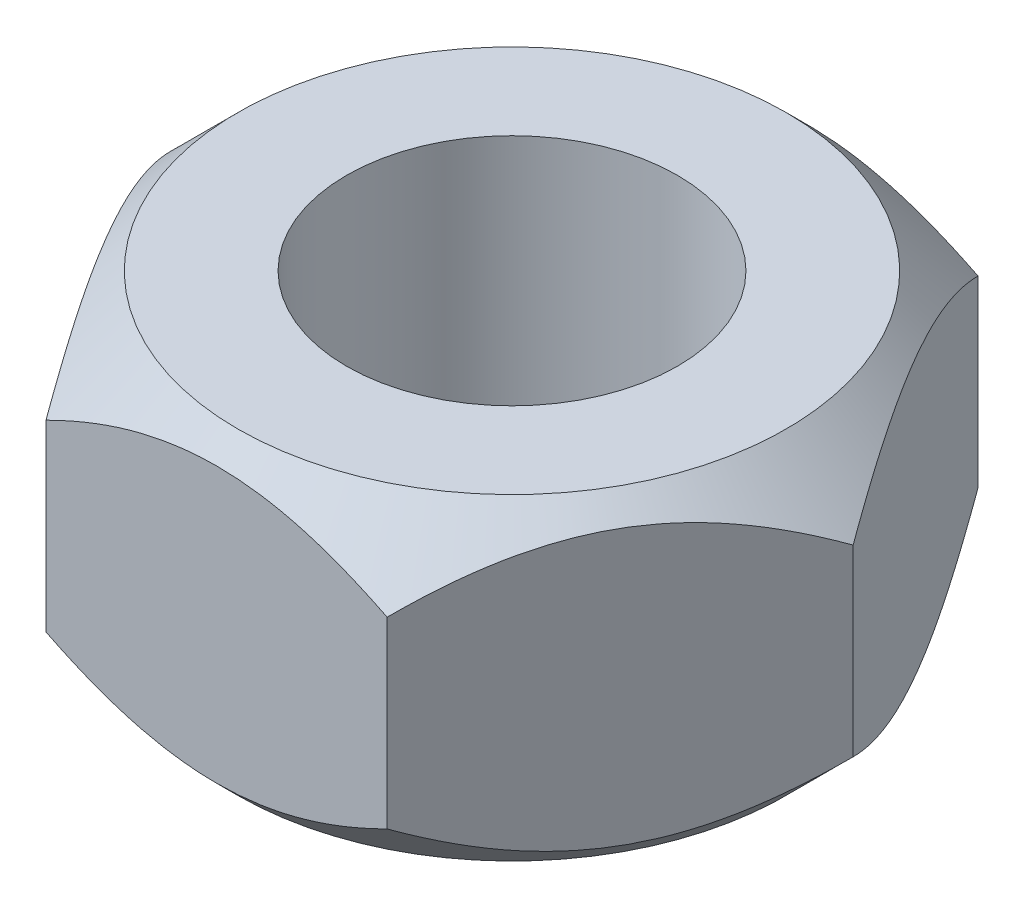
ISO-10303-21;
HEADER;
FILE_DESCRIPTION(('STEP AP214'),'2;1');
FILE_NAME('part.step','',(''),(''),'','','');
FILE_SCHEMA(('AUTOMOTIVE_DESIGN { 1 0 10303 214 1 1 1 1 }'));
ENDSEC;
DATA;
#1=APPLICATION_CONTEXT('core data for automotive mechanical design processes');
#2=APPLICATION_PROTOCOL_DEFINITION('international standard','automotive_design',2000,#1);
#3=PRODUCT_CONTEXT('',#1,'mechanical');
#4=PRODUCT('Part','Part','',(#3));
#5=PRODUCT_RELATED_PRODUCT_CATEGORY('part','',(#4));
#6=PRODUCT_DEFINITION_FORMATION('','',#4);
#7=PRODUCT_DEFINITION_CONTEXT('part definition',#1,'design');
#8=PRODUCT_DEFINITION('design','',#6,#7);
#9=PRODUCT_DEFINITION_SHAPE('','',#8);
#10=(LENGTH_UNIT() NAMED_UNIT(*) SI_UNIT(.MILLI.,.METRE.));
#11=(NAMED_UNIT(*) PLANE_ANGLE_UNIT() SI_UNIT($,.RADIAN.));
#12=(NAMED_UNIT(*) SI_UNIT($,.STERADIAN.) SOLID_ANGLE_UNIT());
#13=UNCERTAINTY_MEASURE_WITH_UNIT(LENGTH_MEASURE(1.E-05),#10,'distance_accuracy_value','');
#14=(GEOMETRIC_REPRESENTATION_CONTEXT(3) GLOBAL_UNCERTAINTY_ASSIGNED_CONTEXT((#13)) GLOBAL_UNIT_ASSIGNED_CONTEXT((#10,
#11,#12)) REPRESENTATION_CONTEXT('',''));
#15=CARTESIAN_POINT('',(0.,0.,0.));
#16=DIRECTION('',(0.,0.,1.));
#17=DIRECTION('',(1.,0.,0.));
#18=AXIS2_PLACEMENT_3D('',#15,#16,#17);
#19=CARTESIAN_POINT('',(-3.20790243318486,2.9845,-5.55625));
#20=DIRECTION('',(0.,1.,0.));
#21=DIRECTION('',(0.,0.,1.));
#22=AXIS2_PLACEMENT_3D('',#19,#20,#21);
#23=PLANE('',#22);
#24=CARTESIAN_POINT('',(0.,2.9845,0.));
#25=DIRECTION('',(0.,1.,0.));
#26=DIRECTION('',(0.,0.,1.));
#27=AXIS2_PLACEMENT_3D('',#24,#25,#26);
#28=CIRCLE('',#27,3.1115);
#29=CARTESIAN_POINT('',(0.,2.9845,3.1115));
#30=VERTEX_POINT('',#29);
#31=EDGE_CURVE('E118',#30,#30,#28,.T.);
#32=ORIENTED_EDGE('',*,*,#31,.F.);
#33=EDGE_LOOP('',(#32));
#34=FACE_BOUND('',#33,.T.);
#35=CARTESIAN_POINT('',(0.,2.9845,0.));
#36=DIRECTION('',(0.,1.,0.));
#37=DIRECTION('',(0.,0.,1.));
#38=AXIS2_PLACEMENT_3D('',#35,#36,#37);
#39=CIRCLE('',#38,5.1562);
#40=CARTESIAN_POINT('',(0.,2.9845,5.1562));
#41=VERTEX_POINT('',#40);
#42=EDGE_CURVE('E138',#41,#41,#39,.T.);
#43=ORIENTED_EDGE('',*,*,#42,.T.);
#44=EDGE_LOOP('',(#43));
#45=FACE_BOUND('',#44,.T.);
#46=ADVANCED_FACE('F38',(#34,#45),#23,.T.);
#47=CARTESIAN_POINT('',(3.20790243318486,2.9845,-5.55625));
#48=DIRECTION('',(0.,0.,1.));
#49=DIRECTION('',(1.,0.,0.));
#50=AXIS2_PLACEMENT_3D('',#47,#48,#49);
#51=PLANE('',#50);
#52=DIRECTION('',(0.,-1.,0.));
#53=VECTOR('',#52,1.);
#54=CARTESIAN_POINT('',(3.20790243318486,2.9845,-5.55625));
#55=LINE('',#54,#53);
#56=CARTESIAN_POINT('',(3.20790243318486,1.72489513363029,-5.55625));
#57=VERTEX_POINT('',#56);
#58=CARTESIAN_POINT('',(3.20790243318486,-1.72489513363029,-5.55625));
#59=VERTEX_POINT('',#58);
#60=EDGE_CURVE('E114',#57,#59,#55,.T.);
#61=ORIENTED_EDGE('',*,*,#60,.T.);
#62=CARTESIAN_POINT('',(-6.58716469272115,0.476878125641333,-5.55625));
#63=CARTESIAN_POINT('',(-6.42759897434799,0.354935686013452,-5.55625));
#64=CARTESIAN_POINT('',(-6.26716138850675,0.234115958327013,-5.55625));
#65=CARTESIAN_POINT('',(-5.94419054054148,-0.00476878868405201,-5.55625));
#66=CARTESIAN_POINT('',(-5.78165678131663,-0.122833135209353,-5.55625));
#67=CARTESIAN_POINT('',(-5.45295294674766,-0.356538146996847,-5.55625));
#68=CARTESIAN_POINT('',(-5.28676447473106,-0.472153023225434,-5.55625));
#69=CARTESIAN_POINT('',(-4.95160120628765,-0.699257298894547,-5.55625));
#70=CARTESIAN_POINT('',(-4.78262660456582,-0.810746984866885,-5.55625));
#71=CARTESIAN_POINT('',(-4.43100221981947,-1.03533013587308,-5.55625));
#72=CARTESIAN_POINT('',(-4.24814791761083,-1.14810500400876,-5.55625));
#73=CARTESIAN_POINT('',(-3.87815305880905,-1.36650801407209,-5.55625));
#74=CARTESIAN_POINT('',(-3.69101180276069,-1.4721349784769,-5.55625));
#75=CARTESIAN_POINT('',(-3.31241641028587,-1.67398189672136,-5.55625));
#76=CARTESIAN_POINT('',(-3.12097712644039,-1.77022949090869,-5.55625));
#77=CARTESIAN_POINT('',(-2.73275367196412,-1.95116173151524,-5.55625));
#78=CARTESIAN_POINT('',(-2.53597203844707,-2.03585175538824,-5.55625));
#79=CARTESIAN_POINT('',(-2.15511884734095,-2.18347146354552,-5.55625));
#80=CARTESIAN_POINT('',(-1.97155135984943,-2.24768832799283,-5.55625));
#81=CARTESIAN_POINT('',(-1.59983135631393,-2.36141837840469,-5.55625));
#82=CARTESIAN_POINT('',(-1.41167854105872,-2.41093060203691,-5.55625));
#83=CARTESIAN_POINT('',(-1.03513439085919,-2.49178158953953,-5.55625));
#84=CARTESIAN_POINT('',(-0.846813640191315,-2.52344361984717,-5.55625));
#85=CARTESIAN_POINT('',(-0.467949294264373,-2.5679493289881,-5.55625));
#86=CARTESIAN_POINT('',(-0.277406137616722,-2.58079665978109,-5.55625));
#87=CARTESIAN_POINT('',(0.0961888430357952,-2.5866285227101,-5.55625));
#88=CARTESIAN_POINT('',(0.279228517917821,-2.58040349207286,-5.55625));
#89=CARTESIAN_POINT('',(0.643830731082311,-2.55022547525135,-5.55625));
#90=CARTESIAN_POINT('',(0.825393130043499,-2.52627083614589,-5.55625));
#91=CARTESIAN_POINT('',(1.18880053870515,-2.46156368670595,-5.55625));
#92=CARTESIAN_POINT('',(1.37059256449986,-2.42051850784193,-5.55625));
#93=CARTESIAN_POINT('',(1.73018969466418,-2.32387551778916,-5.55625));
#94=CARTESIAN_POINT('',(1.90799506409663,-2.26827867723761,-5.55625));
#95=CARTESIAN_POINT('',(2.27157071863707,-2.14061985217526,-5.55625));
#96=CARTESIAN_POINT('',(2.45702885672605,-2.06767853094191,-5.55625));
#97=CARTESIAN_POINT('',(2.82316011598931,-1.91054903999559,-5.55625));
#98=CARTESIAN_POINT('',(3.00383101042669,-1.82635574288271,-5.55625));
#99=CARTESIAN_POINT('',(3.36125061944279,-1.64872081295941,-5.55625));
#100=CARTESIAN_POINT('',(3.5379849666029,-1.55525050530099,-5.55625));
#101=CARTESIAN_POINT('',(3.88739837866309,-1.36112147109617,-5.55625));
#102=CARTESIAN_POINT('',(4.0600780691791,-1.26046386333351,-5.55625));
#103=CARTESIAN_POINT('',(4.39345679128326,-1.05849144282289,-5.55625));
#104=CARTESIAN_POINT('',(4.55432579831417,-0.957455712364276,-5.55625));
#105=CARTESIAN_POINT('',(4.873300549823,-0.751099856717646,-5.55625));
#106=CARTESIAN_POINT('',(5.03140608509287,-0.645779409147224,-5.55625));
#107=CARTESIAN_POINT('',(5.34394061065362,-0.432480295246411,-5.55625));
#108=CARTESIAN_POINT('',(5.49838896306111,-0.324529897192919,-5.55625));
#109=CARTESIAN_POINT('',(5.80516933006379,-0.105747547949723,-5.55625));
#110=CARTESIAN_POINT('',(5.95750191598365,0.00508360118402249,-5.55625));
#111=CARTESIAN_POINT('',(6.10894746272345,0.11709348039263,-5.55625));
#112=B_SPLINE_CURVE_WITH_KNOTS('',3,(#62,#63,#64,#65,#66,#67,#68,#69,#70,#71,#72,#73,#74,#75,
#76,#77,#78,#79,#80,#81,#82,#83,#84,#85,#86,#87,#88,#89,#90,#91,#92,#93,#94,#95,#96,#97,#98,#99,
#100,#101,#102,#103,#104,#105,#106,#107,#108,#109,#110,#111),.UNSPECIFIED.,.F.,.F.,(4,2,2,2,2,2,
2,2,2,2,2,2,2,2,2,2,2,2,2,2,2,2,2,2,4),(0.,0.602490068317835,1.20512574309909,1.81241969099542,
2.41967137733875,3.06404499949269,3.70852451657861,4.35104340427867,4.99326231698966,
5.57618348178354,6.15914278694025,6.73117443800682,7.30309504220085,7.85163808129495,
8.40023226718405,8.95863465486317,9.51699980500329,10.11439916794,10.7120716932762,
11.311652812297,11.9111408024158,12.4809589718086,13.0508200939394,13.616087999598,
14.1812001749851),.UNSPECIFIED.);
#113=CARTESIAN_POINT('',(-3.20790243318486,-1.72489513363029,-5.55625));
#114=VERTEX_POINT('',#113);
#115=EDGE_CURVE('E59',#59,#114,#112,.F.);
#116=ORIENTED_EDGE('',*,*,#115,.T.);
#117=DIRECTION('',(0.,-1.,0.));
#118=VECTOR('',#117,1.);
#119=CARTESIAN_POINT('',(-3.20790243318486,2.9845,-5.55625));
#120=LINE('',#119,#118);
#121=CARTESIAN_POINT('',(-3.20790243318486,1.72489513363029,-5.55625));
#122=VERTEX_POINT('',#121);
#123=EDGE_CURVE('E52',#122,#114,#120,.T.);
#124=ORIENTED_EDGE('',*,*,#123,.F.);
#125=CARTESIAN_POINT('',(-6.59835940382583,-0.48543823704191,-5.55625));
#126=CARTESIAN_POINT('',(-6.43856810067453,-0.363237243894523,-5.55625));
#127=CARTESIAN_POINT('',(-6.27790496400973,-0.242158151216455,-5.55625));
#128=CARTESIAN_POINT('',(-5.95448263127668,-0.00275306593156922,-5.55625));
#129=CARTESIAN_POINT('',(-5.79172293911305,0.115572255760569,-5.55625));
#130=CARTESIAN_POINT('',(-5.46256482457612,0.349802677105666,-5.55625));
#131=CARTESIAN_POINT('',(-5.29614800196142,0.465682004896323,-5.55625));
#132=CARTESIAN_POINT('',(-4.96052631123378,0.693316591413599,-5.55625));
#133=CARTESIAN_POINT('',(-4.79132163776439,0.805072136306378,-5.55625));
#134=CARTESIAN_POINT('',(-4.43917961004767,1.03023000978025,-5.55625));
#135=CARTESIAN_POINT('',(-4.25603673568171,1.1433125285767,-5.55625));
#136=CARTESIAN_POINT('',(-3.88545707411041,1.36232695880489,-5.55625));
#137=CARTESIAN_POINT('',(-3.69801958464599,1.46825768943084,-5.55625));
#138=CARTESIAN_POINT('',(-3.31882144640119,1.67070288371502,-5.55625));
#139=CARTESIAN_POINT('',(-3.12707568396022,1.76724501266209,-5.55625));
#140=CARTESIAN_POINT('',(-2.73822362099179,1.94875041091287,-5.55625));
#141=CARTESIAN_POINT('',(-2.54111986890989,2.03371907324309,-5.55625));
#142=CARTESIAN_POINT('',(-2.15976657401889,2.18179136804636,-5.55625));
#143=CARTESIAN_POINT('',(-1.97602645317706,2.24619358312019,-5.55625));
#144=CARTESIAN_POINT('',(-1.60394723537393,2.3602816703545,-5.55625));
#145=CARTESIAN_POINT('',(-1.41560783915726,2.40996658214596,-5.55625));
#146=CARTESIAN_POINT('',(-1.03868650053877,2.49113450558752,-5.55625));
#147=CARTESIAN_POINT('',(-0.85017561545771,2.5229419979048,-5.55625));
#148=CARTESIAN_POINT('',(-0.470916497685076,2.56770554292561,-5.55625));
#149=CARTESIAN_POINT('',(-0.280168709590943,2.58066527979688,-5.55625));
#150=CARTESIAN_POINT('',(0.0937819219496482,2.58667445461626,-5.55625));
#151=CARTESIAN_POINT('',(0.276972135057729,2.58052150422772,-5.55625));
#152=CARTESIAN_POINT('',(0.641879388971021,2.55045498950042,-5.55625));
#153=CARTESIAN_POINT('',(0.82359629119246,2.52653977354452,-5.55625));
#154=CARTESIAN_POINT('',(1.18731847720738,2.46187907858606,-5.55625));
#155=CARTESIAN_POINT('',(1.36927068367381,2.42083996086929,-5.55625));
#156=CARTESIAN_POINT('',(1.72918300612716,2.32417969252025,-5.55625));
#157=CARTESIAN_POINT('',(1.90714338346456,2.26855949957358,-5.55625));
#158=CARTESIAN_POINT('',(2.27080293040271,2.14090884840685,-5.55625));
#159=CARTESIAN_POINT('',(2.45619546621416,2.06801437106223,-5.55625));
#160=CARTESIAN_POINT('',(2.82219886337606,1.91098330539244,-5.55625));
#161=CARTESIAN_POINT('',(3.0028075022317,1.8268415979182,-5.55625));
#162=CARTESIAN_POINT('',(3.36010458540898,1.64931313942241,-5.55625));
#163=CARTESIAN_POINT('',(3.53677868125748,1.55589774408657,-5.55625));
#164=CARTESIAN_POINT('',(3.88607358666566,1.36188029033257,-5.55625));
#165=CARTESIAN_POINT('',(4.05869502080687,1.26127934911424,-5.55625));
#166=CARTESIAN_POINT('',(4.39196371579547,1.05941711133094,-5.55625));
#167=CARTESIAN_POINT('',(4.55278084095246,0.95843477464817,-5.55625));
#168=CARTESIAN_POINT('',(4.87165264984985,0.752186149742702,-5.55625));
#169=CARTESIAN_POINT('',(5.02970712452459,0.646919539293572,-5.55625));
#170=CARTESIAN_POINT('',(5.34214104908368,0.433727508042609,-5.55625));
#171=CARTESIAN_POINT('',(5.49653984830345,0.325830341936151,-5.55625));
#172=CARTESIAN_POINT('',(5.80322150613526,0.107154506056544,-5.55625));
#173=CARTESIAN_POINT('',(5.95550493600945,-0.00362336161582645,-5.55625));
#174=CARTESIAN_POINT('',(6.10690143830326,-0.115579987963722,-5.55625));
#175=B_SPLINE_CURVE_WITH_KNOTS('',3,(#125,#126,#127,#128,#129,#130,#131,#132,#133,#134,#135,
#136,#137,#138,#139,#140,#141,#142,#143,#144,#145,#146,#147,#148,#149,#150,#151,#152,#153,#154,
#155,#156,#157,#158,#159,#160,#161,#162,#163,#164,#165,#166,#167,#168,#169,#170,#171,#172,#173,
#174),.UNSPECIFIED.,.F.,.F.,(4,2,2,2,2,2,2,2,2,2,2,2,2,2,2,2,2,2,2,2,2,2,2,2,4),(0.,
0.603498786457322,1.20714309880031,1.81545262490647,2.42371985823581,3.06931496865048,
3.71501641156752,4.35875353774578,5.00218966025262,5.58578316732119,6.16941474805749,
6.74207957260603,7.31463244340017,7.86361723193485,8.41265307399219,8.97151802144452,
9.53034627181685,10.1275114979222,10.7249494537119,11.3242938444236,11.923545251802,
12.4931464224893,13.0627905131618,13.6278450792169,14.192743961769),.UNSPECIFIED.);
#176=EDGE_CURVE('E137',#57,#122,#175,.F.);
#177=ORIENTED_EDGE('',*,*,#176,.F.);
#178=EDGE_LOOP('',(#61,#116,#124,#177));
#179=FACE_BOUND('',#178,.T.);
#180=ADVANCED_FACE('F40',(#179),#51,.F.);
#181=CARTESIAN_POINT('',(-3.20790243318486,2.9845,-5.55625));
#182=DIRECTION('',(0.866025403784439,0.,0.5));
#183=DIRECTION('',(0.5,0.,-0.866025403784439));
#184=AXIS2_PLACEMENT_3D('',#181,#182,#183);
#185=PLANE('',#184);
#186=ORIENTED_EDGE('',*,*,#123,.T.);
#187=CARTESIAN_POINT('',(-3.20778696313102,-1.7247796604592,-5.55645));
#188=CARTESIAN_POINT('',(-3.26294502630456,-1.77993242203482,-5.46091343213634));
#189=CARTESIAN_POINT('',(-3.31852706224861,-1.83339263942161,-5.36464252189313));
#190=CARTESIAN_POINT('',(-3.43062225818461,-1.93641311667276,-5.17048794724758));
#191=CARTESIAN_POINT('',(-3.48713590663451,-1.985971246525,-5.07260343681127));
#192=CARTESIAN_POINT('',(-3.6587240703033,-2.12844281917033,-4.77540401935948));
#193=CARTESIAN_POINT('',(-3.77525117089692,-2.21454564665251,-4.57357316067263));
#194=CARTESIAN_POINT('',(-4.01023739378267,-2.36199085611819,-4.16656508355582));
#195=CARTESIAN_POINT('',(-4.12863645427789,-2.42370470595628,-3.96149189520967));
#196=CARTESIAN_POINT('',(-4.30818158421301,-2.49509250337744,-3.65051060791049));
#197=CARTESIAN_POINT('',(-4.36829430156956,-2.51534839260829,-3.54639232726793));
#198=CARTESIAN_POINT('',(-4.48902872199999,-2.5483408034146,-3.33727417686004));
#199=CARTESIAN_POINT('',(-4.54965034763144,-2.56107844876182,-3.23227444122895));
#200=CARTESIAN_POINT('',(-4.69737632802703,-2.58243487487139,-2.97640553758585));
#201=CARTESIAN_POINT('',(-4.78463985035014,-2.58691592717982,-2.82526068327482));
#202=CARTESIAN_POINT('',(-4.95900962187742,-2.57939519640635,-2.52324337968538));
#203=CARTESIAN_POINT('',(-5.04611580523527,-2.56738763540787,-2.37237104445617));
#204=CARTESIAN_POINT('',(-5.21950695589982,-2.52759747805152,-2.07204876192234));
#205=CARTESIAN_POINT('',(-5.30579089490739,-2.49979724001053,-1.92260059568406));
#206=CARTESIAN_POINT('',(-5.4768757650541,-2.42993312732754,-1.62627290818363));
#207=CARTESIAN_POINT('',(-5.5616768093829,-2.38787034639007,-1.47939319087125));
#208=CARTESIAN_POINT('',(-5.71221493158858,-2.3013336350814,-1.218653514735));
#209=CARTESIAN_POINT('',(-5.7782853256609,-2.2591354571075,-1.10421623532564));
#210=CARTESIAN_POINT('',(-5.9092400536356,-2.16793889719049,-0.877395992982099));
#211=CARTESIAN_POINT('',(-5.97412435147949,-2.118940308896,-0.765013092503062));
#212=CARTESIAN_POINT('',(-6.10250252581459,-2.01524132435942,-0.542655571971716));
#213=CARTESIAN_POINT('',(-6.16600005347445,-1.96055885880868,-0.43267462790984));
#214=CARTESIAN_POINT('',(-6.29181929109853,-1.84621006386822,-0.214749315775358));
#215=CARTESIAN_POINT('',(-6.35414169387201,-1.78654679124865,-0.106803747721918));
#216=CARTESIAN_POINT('',(-6.41592033642355,-1.72477966045921,0.000199999999999559));
#217=B_SPLINE_CURVE_WITH_KNOTS('',3,(#187,#188,#189,#190,#191,#192,#193,#194,#195,#196,#197,
#198,#199,#200,#201,#202,#203,#204,#205,#206,#207,#208,#209,#210,#211,#212,#213,#214,#215,#216),
.UNSPECIFIED.,.F.,.F.,(4,2,2,2,2,2,2,2,2,2,2,2,2,2,4),(0.,0.369982774103464,0.740166128456627,
1.48452951278214,2.21707291656615,2.58262618134807,2.94812479207227,3.47106468924809,
3.99418788105353,4.51789659566179,5.04156515942817,5.4575151537856,5.8734777724733,
6.28816585755633,6.70260128950947),.UNSPECIFIED.);
#218=CARTESIAN_POINT('',(-6.41580486636972,-1.72489513363029,0.));
#219=VERTEX_POINT('',#218);
#220=EDGE_CURVE('E133',#114,#219,#217,.T.);
#221=ORIENTED_EDGE('',*,*,#220,.T.);
#222=DIRECTION('',(0.,-1.,0.));
#223=VECTOR('',#222,1.);
#224=CARTESIAN_POINT('',(-6.41580486636972,2.9845,0.));
#225=LINE('',#224,#223);
#226=CARTESIAN_POINT('',(-6.41580486636972,1.72489513363029,0.));
#227=VERTEX_POINT('',#226);
#228=EDGE_CURVE('E124',#227,#219,#225,.T.);
#229=ORIENTED_EDGE('',*,*,#228,.F.);
#230=CARTESIAN_POINT('',(-3.20778696313102,1.7247796604592,-5.55645));
#231=CARTESIAN_POINT('',(-3.26294502630456,1.77993242203482,-5.46091343213634));
#232=CARTESIAN_POINT('',(-3.31852706224861,1.83339263942161,-5.36464252189313));
#233=CARTESIAN_POINT('',(-3.43062225818461,1.93641311667276,-5.17048794724758));
#234=CARTESIAN_POINT('',(-3.48713590663451,1.985971246525,-5.07260343681127));
#235=CARTESIAN_POINT('',(-3.6587240703033,2.12844281917033,-4.77540401935948));
#236=CARTESIAN_POINT('',(-3.77525117089692,2.21454564665251,-4.57357316067264));
#237=CARTESIAN_POINT('',(-4.01023739378267,2.36199085611819,-4.16656508355582));
#238=CARTESIAN_POINT('',(-4.12863645427789,2.42370470595628,-3.96149189520967));
#239=CARTESIAN_POINT('',(-4.30818158421301,2.49509250337744,-3.65051060791049));
#240=CARTESIAN_POINT('',(-4.36829430156955,2.51534839260829,-3.54639232726793));
#241=CARTESIAN_POINT('',(-4.48902872199999,2.5483408034146,-3.33727417686004));
#242=CARTESIAN_POINT('',(-4.54965034763144,2.56107844876182,-3.23227444122895));
#243=CARTESIAN_POINT('',(-4.69737632802703,2.58243487487139,-2.97640553758585));
#244=CARTESIAN_POINT('',(-4.78463985035014,2.58691592717982,-2.82526068327482));
#245=CARTESIAN_POINT('',(-4.95900962187742,2.57939519640635,-2.52324337968539));
#246=CARTESIAN_POINT('',(-5.04611580523527,2.56738763540787,-2.37237104445617));
#247=CARTESIAN_POINT('',(-5.21950695589982,2.52759747805152,-2.07204876192234));
#248=CARTESIAN_POINT('',(-5.30579089490739,2.49979724001053,-1.92260059568406));
#249=CARTESIAN_POINT('',(-5.4768757650541,2.42993312732754,-1.62627290818363));
#250=CARTESIAN_POINT('',(-5.5616768093829,2.38787034639007,-1.47939319087125));
#251=CARTESIAN_POINT('',(-5.71221493158858,2.3013336350814,-1.218653514735));
#252=CARTESIAN_POINT('',(-5.7782853256609,2.2591354571075,-1.10421623532564));
#253=CARTESIAN_POINT('',(-5.9092400536356,2.16793889719049,-0.877395992982099));
#254=CARTESIAN_POINT('',(-5.97412435147949,2.118940308896,-0.765013092503062));
#255=CARTESIAN_POINT('',(-6.1025025258146,2.01524132435942,-0.542655571971717));
#256=CARTESIAN_POINT('',(-6.16600005347445,1.96055885880868,-0.432674627909841));
#257=CARTESIAN_POINT('',(-6.29181929109853,1.84621006386822,-0.214749315775358));
#258=CARTESIAN_POINT('',(-6.35414169387201,1.78654679124865,-0.106803747721918));
#259=CARTESIAN_POINT('',(-6.41592033642355,1.72477966045921,0.000199999999999559));
#260=B_SPLINE_CURVE_WITH_KNOTS('',3,(#230,#231,#232,#233,#234,#235,#236,#237,#238,#239,#240,
#241,#242,#243,#244,#245,#246,#247,#248,#249,#250,#251,#252,#253,#254,#255,#256,#257,#258,#259),
.UNSPECIFIED.,.F.,.F.,(4,2,2,2,2,2,2,2,2,2,2,2,2,2,4),(0.,0.369982774103464,0.740166128456627,
1.48452951278214,2.21707291656615,2.58262618134806,2.94812479207227,3.47106468924808,
3.99418788105353,4.51789659566178,5.04156515942817,5.4575151537856,5.8734777724733,
6.28816585755633,6.70260128950947),.UNSPECIFIED.);
#261=EDGE_CURVE('E134',#122,#227,#260,.T.);
#262=ORIENTED_EDGE('',*,*,#261,.F.);
#263=EDGE_LOOP('',(#186,#221,#229,#262));
#264=FACE_BOUND('',#263,.T.);
#265=ADVANCED_FACE('F131',(#264),#185,.F.);
#266=CARTESIAN_POINT('',(-6.41580486636972,2.9845,0.));
#267=DIRECTION('',(0.866025403784439,0.,-0.5));
#268=DIRECTION('',(-0.5,0.,-0.866025403784439));
#269=AXIS2_PLACEMENT_3D('',#266,#267,#268);
#270=PLANE('',#269);
#271=ORIENTED_EDGE('',*,*,#228,.T.);
#272=CARTESIAN_POINT('',(-6.41592033642355,-1.72477966045921,-0.000200000000000268));
#273=CARTESIAN_POINT('',(-6.36076227325002,-1.77993242203482,0.0953365678636604));
#274=CARTESIAN_POINT('',(-6.30518023730597,-1.83339263942161,0.191607478106872));
#275=CARTESIAN_POINT('',(-6.19308504136997,-1.93641311667276,0.385762052752415));
#276=CARTESIAN_POINT('',(-6.13657139292006,-1.985971246525,0.483646563188731));
#277=CARTESIAN_POINT('',(-5.96498322925127,-2.12844281917033,0.780845980640522));
#278=CARTESIAN_POINT('',(-5.84845612865765,-2.21454564665251,0.982676839327363));
#279=CARTESIAN_POINT('',(-5.61346990577191,-2.36199085611819,1.38968491644418));
#280=CARTESIAN_POINT('',(-5.49507084527668,-2.42370470595628,1.59475810479033));
#281=CARTESIAN_POINT('',(-5.31552571534156,-2.49509250337744,1.90573939208951));
#282=CARTESIAN_POINT('',(-5.25541299798502,-2.51534839260829,2.00985767273207));
#283=CARTESIAN_POINT('',(-5.13467857755459,-2.5483408034146,2.21897582313996));
#284=CARTESIAN_POINT('',(-5.07405695192314,-2.56107844876182,2.32397555877105));
#285=CARTESIAN_POINT('',(-4.92633097152755,-2.58243487487139,2.57984446241414));
#286=CARTESIAN_POINT('',(-4.83906744920444,-2.58691592717982,2.73098931672518));
#287=CARTESIAN_POINT('',(-4.66469767767716,-2.57939519640635,3.03300662031461));
#288=CARTESIAN_POINT('',(-4.57759149431931,-2.56738763540787,3.18387895554382));
#289=CARTESIAN_POINT('',(-4.40420034365476,-2.52759747805152,3.48420123807765));
#290=CARTESIAN_POINT('',(-4.31791640464719,-2.49979724001053,3.63364940431594));
#291=CARTESIAN_POINT('',(-4.14683153450048,-2.42993312732755,3.92997709181636));
#292=CARTESIAN_POINT('',(-4.06203049017168,-2.38787034639007,4.07685680912874));
#293=CARTESIAN_POINT('',(-3.911492367966,-2.3013336350814,4.337596485265));
#294=CARTESIAN_POINT('',(-3.84542197389367,-2.25913545710751,4.45203376467436));
#295=CARTESIAN_POINT('',(-3.71446724591897,-2.16793889719049,4.6788540070179));
#296=CARTESIAN_POINT('',(-3.64958294807509,-2.118940308896,4.79123690749693));
#297=CARTESIAN_POINT('',(-3.52120477373998,-2.01524132435942,5.01359442802828));
#298=CARTESIAN_POINT('',(-3.45770724608013,-1.96055885880868,5.12357537209016));
#299=CARTESIAN_POINT('',(-3.33188800845605,-1.84621006386822,5.34150068422464));
#300=CARTESIAN_POINT('',(-3.26956560568257,-1.78654679124865,5.44944625227808));
#301=CARTESIAN_POINT('',(-3.20778696313102,-1.72477966045921,5.55645));
#302=B_SPLINE_CURVE_WITH_KNOTS('',3,(#272,#273,#274,#275,#276,#277,#278,#279,#280,#281,#282,
#283,#284,#285,#286,#287,#288,#289,#290,#291,#292,#293,#294,#295,#296,#297,#298,#299,#300,#301),
.UNSPECIFIED.,.F.,.F.,(4,2,2,2,2,2,2,2,2,2,2,2,2,2,4),(0.,0.369982774103463,0.740166128456623,
1.48452951278213,2.21707291656614,2.58262618134806,2.94812479207227,3.47106468924808,
3.99418788105352,4.51789659566178,5.04156515942817,5.45751515378559,5.87347777247329,
6.28816585755633,6.70260128950947),.UNSPECIFIED.);
#303=CARTESIAN_POINT('',(-3.20790243318486,-1.72489513363029,5.55625));
#304=VERTEX_POINT('',#303);
#305=EDGE_CURVE('E142',#219,#304,#302,.T.);
#306=ORIENTED_EDGE('',*,*,#305,.T.);
#307=DIRECTION('',(0.,-1.,0.));
#308=VECTOR('',#307,1.);
#309=CARTESIAN_POINT('',(-3.20790243318486,2.9845,5.55625));
#310=LINE('',#309,#308);
#311=CARTESIAN_POINT('',(-3.20790243318486,1.72489513363029,5.55625));
#312=VERTEX_POINT('',#311);
#313=EDGE_CURVE('E116',#312,#304,#310,.T.);
#314=ORIENTED_EDGE('',*,*,#313,.F.);
#315=CARTESIAN_POINT('',(-6.41592033642355,1.72477966045921,-0.000200000000000268));
#316=CARTESIAN_POINT('',(-6.36076227325002,1.77993242203482,0.0953365678636604));
#317=CARTESIAN_POINT('',(-6.30518023730597,1.83339263942161,0.191607478106872));
#318=CARTESIAN_POINT('',(-6.19308504136997,1.93641311667276,0.385762052752415));
#319=CARTESIAN_POINT('',(-6.13657139292006,1.985971246525,0.483646563188731));
#320=CARTESIAN_POINT('',(-5.96498322925127,2.12844281917033,0.780845980640522));
#321=CARTESIAN_POINT('',(-5.84845612865765,2.21454564665251,0.982676839327363));
#322=CARTESIAN_POINT('',(-5.61346990577191,2.36199085611819,1.38968491644418));
#323=CARTESIAN_POINT('',(-5.49507084527668,2.42370470595628,1.59475810479033));
#324=CARTESIAN_POINT('',(-5.31552571534156,2.49509250337744,1.90573939208951));
#325=CARTESIAN_POINT('',(-5.25541299798502,2.51534839260829,2.00985767273207));
#326=CARTESIAN_POINT('',(-5.13467857755459,2.5483408034146,2.21897582313996));
#327=CARTESIAN_POINT('',(-5.07405695192314,2.56107844876182,2.32397555877105));
#328=CARTESIAN_POINT('',(-4.92633097152755,2.58243487487139,2.57984446241414));
#329=CARTESIAN_POINT('',(-4.83906744920444,2.58691592717982,2.73098931672518));
#330=CARTESIAN_POINT('',(-4.66469767767716,2.57939519640635,3.03300662031461));
#331=CARTESIAN_POINT('',(-4.57759149431931,2.56738763540787,3.18387895554382));
#332=CARTESIAN_POINT('',(-4.40420034365476,2.52759747805152,3.48420123807765));
#333=CARTESIAN_POINT('',(-4.31791640464719,2.49979724001053,3.63364940431594));
#334=CARTESIAN_POINT('',(-4.14683153450048,2.42993312732755,3.92997709181636));
#335=CARTESIAN_POINT('',(-4.06203049017168,2.38787034639007,4.07685680912874));
#336=CARTESIAN_POINT('',(-3.911492367966,2.3013336350814,4.337596485265));
#337=CARTESIAN_POINT('',(-3.84542197389367,2.25913545710751,4.45203376467436));
#338=CARTESIAN_POINT('',(-3.71446724591897,2.16793889719049,4.6788540070179));
#339=CARTESIAN_POINT('',(-3.64958294807509,2.118940308896,4.79123690749693));
#340=CARTESIAN_POINT('',(-3.52120477373998,2.01524132435942,5.01359442802828));
#341=CARTESIAN_POINT('',(-3.45770724608013,1.96055885880868,5.12357537209016));
#342=CARTESIAN_POINT('',(-3.33188800845605,1.84621006386822,5.34150068422464));
#343=CARTESIAN_POINT('',(-3.26956560568257,1.78654679124865,5.44944625227808));
#344=CARTESIAN_POINT('',(-3.20778696313102,1.72477966045921,5.55645));
#345=B_SPLINE_CURVE_WITH_KNOTS('',3,(#315,#316,#317,#318,#319,#320,#321,#322,#323,#324,#325,
#326,#327,#328,#329,#330,#331,#332,#333,#334,#335,#336,#337,#338,#339,#340,#341,#342,#343,#344),
.UNSPECIFIED.,.F.,.F.,(4,2,2,2,2,2,2,2,2,2,2,2,2,2,4),(0.,0.369982774103463,0.740166128456623,
1.48452951278213,2.21707291656614,2.58262618134806,2.94812479207227,3.47106468924808,
3.99418788105352,4.51789659566178,5.04156515942817,5.45751515378559,5.87347777247329,
6.28816585755633,6.70260128950947),.UNSPECIFIED.);
#346=EDGE_CURVE('E191',#227,#312,#345,.T.);
#347=ORIENTED_EDGE('',*,*,#346,.F.);
#348=EDGE_LOOP('',(#271,#306,#314,#347));
#349=FACE_BOUND('',#348,.T.);
#350=ADVANCED_FACE('F182',(#349),#270,.F.);
#351=CARTESIAN_POINT('',(-3.20790243318486,2.9845,5.55625));
#352=DIRECTION('',(0.,0.,-1.));
#353=DIRECTION('',(-1.,0.,0.));
#354=AXIS2_PLACEMENT_3D('',#351,#352,#353);
#355=PLANE('',#354);
#356=ORIENTED_EDGE('',*,*,#313,.T.);
#357=CARTESIAN_POINT('',(-6.58716469267499,0.47687812560604,5.55625));
#358=CARTESIAN_POINT('',(-6.42759897430314,0.354935685979523,5.55625));
#359=CARTESIAN_POINT('',(-6.26716138846322,0.234115958294446,5.55625));
#360=CARTESIAN_POINT('',(-5.94419054050062,-0.00476878871390234,5.55625));
#361=CARTESIAN_POINT('',(-5.7816567812771,-0.122833135237849,5.55625));
#362=CARTESIAN_POINT('',(-5.45295294671085,-0.356538147022625,5.55625));
#363=CARTESIAN_POINT('',(-5.28676447469563,-0.47215302324985,5.55625));
#364=CARTESIAN_POINT('',(-4.95160120625501,-0.699257298916258,5.55625));
#365=CARTESIAN_POINT('',(-4.78262660453458,-0.810746984887253,5.55625));
#366=CARTESIAN_POINT('',(-4.43100221979127,-1.03533013589065,5.55625));
#367=CARTESIAN_POINT('',(-4.24814791758426,-1.14810500402488,5.55625));
#368=CARTESIAN_POINT('',(-3.8781530587858,-1.36650801408537,5.55625));
#369=CARTESIAN_POINT('',(-3.69101180273913,-1.47213497848881,5.55625));
#370=CARTESIAN_POINT('',(-3.31241641026776,-1.67398189673061,5.55625));
#371=CARTESIAN_POINT('',(-3.12097712642402,-1.77022949091667,5.55625));
#372=CARTESIAN_POINT('',(-2.73275367195135,-1.95116173152084,5.55625));
#373=CARTESIAN_POINT('',(-2.53597203843615,-2.03585175539273,5.55625));
#374=CARTESIAN_POINT('',(-2.1551188473308,-2.18347146354922,5.55625));
#375=CARTESIAN_POINT('',(-1.97155135983814,-2.24768832799665,5.55625));
#376=CARTESIAN_POINT('',(-1.5998313563003,-2.36141837840851,5.55625));
#377=CARTESIAN_POINT('',(-1.4116785410439,-2.41093060204061,5.55625));
#378=CARTESIAN_POINT('',(-1.03513439084204,-2.49178158954271,5.55625));
#379=CARTESIAN_POINT('',(-0.846813640173009,-2.52344361984997,5.55625));
#380=CARTESIAN_POINT('',(-0.4679492942438,-2.56794932898987,5.55625));
#381=CARTESIAN_POINT('',(-0.277406137595033,-2.58079665978221,5.55625));
#382=CARTESIAN_POINT('',(0.0961888430594437,-2.58662852270973,5.55625));
#383=CARTESIAN_POINT('',(0.279228517942314,-2.58040349207166,5.55625));
#384=CARTESIAN_POINT('',(0.643830731108402,-2.55022547524838,5.55625));
#385=CARTESIAN_POINT('',(0.825393130070344,-2.52627083614196,5.55625));
#386=CARTESIAN_POINT('',(1.18880053873349,-2.46156368670004,5.55625));
#387=CARTESIAN_POINT('',(1.37059256452892,-2.42051850783499,5.55625));
#388=CARTESIAN_POINT('',(1.73018969469463,-2.32387551778011,5.55625));
#389=CARTESIAN_POINT('',(1.90799506412774,-2.26827867722752,5.55625));
#390=CARTESIAN_POINT('',(2.27157071867183,-2.14061985216217,5.55625));
#391=CARTESIAN_POINT('',(2.45702885676374,-2.06767853092672,5.55625));
#392=CARTESIAN_POINT('',(2.8231601160327,-1.91054903997598,5.55625));
#393=CARTESIAN_POINT('',(3.00383101047286,-1.82635574286079,5.55625));
#394=CARTESIAN_POINT('',(3.36125061949442,-1.64872081293272,5.55625));
#395=CARTESIAN_POINT('',(3.53798496665721,-1.55525050527185,5.55625));
#396=CARTESIAN_POINT('',(3.88739837872266,-1.36112147106204,5.55625));
#397=CARTESIAN_POINT('',(4.06007806924127,-1.26046386329685,5.55625));
#398=CARTESIAN_POINT('',(4.39345679135013,-1.05849144278143,5.55625));
#399=CARTESIAN_POINT('',(4.55432579838316,-0.957455712320547,5.55625));
#400=CARTESIAN_POINT('',(4.87330054989621,-0.75109985666938,5.55625));
#401=CARTESIAN_POINT('',(5.03140608516817,-0.645779409096686,5.55625));
#402=CARTESIAN_POINT('',(5.34394061073306,-0.432480295191352,5.55625));
#403=CARTESIAN_POINT('',(5.49838896314259,-0.324529897135613,5.55625));
#404=CARTESIAN_POINT('',(5.80516933014933,-0.105747547887925,5.55625));
#405=CARTESIAN_POINT('',(5.95750191607122,0.00508360124806539,5.55625));
#406=CARTESIAN_POINT('',(6.10894746281304,0.117093480458914,5.55625));
#407=B_SPLINE_CURVE_WITH_KNOTS('',3,(#357,#358,#359,#360,#361,#362,#363,#364,#365,#366,#367,
#368,#369,#370,#371,#372,#373,#374,#375,#376,#377,#378,#379,#380,#381,#382,#383,#384,#385,#386,
#387,#388,#389,#390,#391,#392,#393,#394,#395,#396,#397,#398,#399,#400,#401,#402,#403,#404,#405,
#406),.UNSPECIFIED.,.F.,.F.,(4,2,2,2,2,2,2,2,2,2,2,2,2,2,2,2,2,2,2,2,2,2,2,2,4),(0.,
0.602490068312204,1.20512574308783,1.81241969097842,2.41967137731602,3.0640449994635,
3.70852451654297,4.35104340423664,4.99326231694123,5.57618348173846,6.15914278689851,
6.73117443796827,7.3030950421655,7.85163808126221,8.40023226715392,8.95863465483586,
9.51699980497881,10.114399167926,10.7120716932727,11.311652812304,11.9111408024333,
12.4809589718351,13.050820093975,13.6160879996425,14.1812001750384),.UNSPECIFIED.);
#408=CARTESIAN_POINT('',(3.20790243318486,-1.72489513363029,5.55625));
#409=VERTEX_POINT('',#408);
#410=EDGE_CURVE('E111',#304,#409,#407,.T.);
#411=ORIENTED_EDGE('',*,*,#410,.T.);
#412=DIRECTION('',(0.,-1.,0.));
#413=VECTOR('',#412,1.);
#414=CARTESIAN_POINT('',(3.20790243318486,2.9845,5.55625));
#415=LINE('',#414,#413);
#416=CARTESIAN_POINT('',(3.20790243318486,1.72489513363029,5.55625));
#417=VERTEX_POINT('',#416);
#418=EDGE_CURVE('E110',#417,#409,#415,.T.);
#419=ORIENTED_EDGE('',*,*,#418,.F.);
#420=CARTESIAN_POINT('',(-6.59835940379093,-0.485438237015215,5.55625));
#421=CARTESIAN_POINT('',(-6.43856810064063,-0.36323724386886,5.55625));
#422=CARTESIAN_POINT('',(-6.27790496397683,-0.242158151191822,5.55625));
#423=CARTESIAN_POINT('',(-5.9544826312458,-0.00275306590899111,5.55625));
#424=CARTESIAN_POINT('',(-5.79172293908318,0.115572255782123,5.55625));
#425=CARTESIAN_POINT('',(-5.46256482454831,0.349802677125164,5.55625));
#426=CARTESIAN_POINT('',(-5.29614800193465,0.465682004914789,5.55625));
#427=CARTESIAN_POINT('',(-4.96052631120912,0.693316591430019,5.55625));
#428=CARTESIAN_POINT('',(-4.7913216377408,0.805072136321782,5.55625));
#429=CARTESIAN_POINT('',(-4.43917961002636,1.03023000979354,5.55625));
#430=CARTESIAN_POINT('',(-4.25603673566164,1.1433125285889,5.55625));
#431=CARTESIAN_POINT('',(-3.88545707409286,1.36232695881494,5.55625));
#432=CARTESIAN_POINT('',(-3.69801958462972,1.46825768943984,5.55625));
#433=CARTESIAN_POINT('',(-3.31882144638752,1.67070288372201,5.55625));
#434=CARTESIAN_POINT('',(-3.12707568394788,1.76724501266812,5.55625));
#435=CARTESIAN_POINT('',(-2.73822362098216,1.9487504109171,5.55625));
#436=CARTESIAN_POINT('',(-2.54111986890166,2.03371907324648,5.55625));
#437=CARTESIAN_POINT('',(-2.15976657401125,2.18179136804915,5.55625));
#438=CARTESIAN_POINT('',(-1.97602645316856,2.24619358312307,5.55625));
#439=CARTESIAN_POINT('',(-1.60394723536366,2.36028167035738,5.55625));
#440=CARTESIAN_POINT('',(-1.41560783914608,2.40996658214875,5.55625));
#441=CARTESIAN_POINT('',(-1.03868650052583,2.49113450558993,5.55625));
#442=CARTESIAN_POINT('',(-0.85017561544389,2.52294199790693,5.55625));
#443=CARTESIAN_POINT('',(-0.470916497669537,2.56770554292695,5.55625));
#444=CARTESIAN_POINT('',(-0.280168709574558,2.58066527979774,5.55625));
#445=CARTESIAN_POINT('',(0.0937819219675129,2.58667445461599,5.55625));
#446=CARTESIAN_POINT('',(0.276972135076229,2.58052150422681,5.55625));
#447=CARTESIAN_POINT('',(0.641879388990723,2.55045498949818,5.55625));
#448=CARTESIAN_POINT('',(0.823596291212729,2.52653977354156,5.55625));
#449=CARTESIAN_POINT('',(1.18731847722877,2.4618790785816,5.55625));
#450=CARTESIAN_POINT('',(1.36927068369575,2.42083996086405,5.55625));
#451=CARTESIAN_POINT('',(1.72918300615014,2.32417969251343,5.55625));
#452=CARTESIAN_POINT('',(1.90714338348803,2.26855949956596,5.55625));
#453=CARTESIAN_POINT('',(2.27080293042894,2.14090884839698,5.55625));
#454=CARTESIAN_POINT('',(2.4561954662426,2.06801437105077,5.55625));
#455=CARTESIAN_POINT('',(2.8221988634088,1.91098330537766,5.55625));
#456=CARTESIAN_POINT('',(3.00280750226653,1.82684159790167,5.55625));
#457=CARTESIAN_POINT('',(3.36010458544793,1.64931313940228,5.55625));
#458=CARTESIAN_POINT('',(3.53677868129846,1.55589774406459,5.55625));
#459=CARTESIAN_POINT('',(3.88607358671061,1.36188029030683,5.55625));
#460=CARTESIAN_POINT('',(4.05869502085378,1.26127934908659,5.55625));
#461=CARTESIAN_POINT('',(4.39196371584591,1.05941711129967,5.55625));
#462=CARTESIAN_POINT('',(4.55278084100451,0.958434774615187,5.55625));
#463=CARTESIAN_POINT('',(4.87165264990508,0.752186149706298,5.55625));
#464=CARTESIAN_POINT('',(5.0297071245814,0.646919539255454,5.55625));
#465=CARTESIAN_POINT('',(5.3421410491436,0.433727508001081,5.55625));
#466=CARTESIAN_POINT('',(5.49653984836492,0.325830341892929,5.55625));
#467=CARTESIAN_POINT('',(5.80322150619979,0.107154506009934,5.55625));
#468=CARTESIAN_POINT('',(5.95550493607551,-0.00362336166412953,5.55625));
#469=CARTESIAN_POINT('',(6.10690143837085,-0.115579988013714,5.55625));
#470=B_SPLINE_CURVE_WITH_KNOTS('',3,(#420,#421,#422,#423,#424,#425,#426,#427,#428,#429,#430,
#431,#432,#433,#434,#435,#436,#437,#438,#439,#440,#441,#442,#443,#444,#445,#446,#447,#448,#449,
#450,#451,#452,#453,#454,#455,#456,#457,#458,#459,#460,#461,#462,#463,#464,#465,#466,#467,#468,
#469),.UNSPECIFIED.,.F.,.F.,(4,2,2,2,2,2,2,2,2,2,2,2,2,2,2,2,2,2,2,2,2,2,2,2,4),(0.,
0.603498786453063,1.20714309879179,1.8154526248936,2.42371985821861,3.0693149686284,
3.71501641154056,4.35875353771397,5.00218966021598,5.58578316728708,6.16941474802592,
6.74207957257687,7.31463244337343,7.86361723191007,8.41265307396937,8.97151802142384,
9.53034627179829,10.1275114979116,10.7249494537092,11.3242938444288,11.9235452518151,
12.4931464225092,13.0627905131885,13.6278450792503,14.1927439618091),.UNSPECIFIED.);
#471=EDGE_CURVE('E197',#312,#417,#470,.T.);
#472=ORIENTED_EDGE('',*,*,#471,.F.);
#473=EDGE_LOOP('',(#356,#411,#419,#472));
#474=FACE_BOUND('',#473,.T.);
#475=ADVANCED_FACE('F185',(#474),#355,.F.);
#476=CARTESIAN_POINT('',(3.20790243318486,2.9845,5.55625));
#477=DIRECTION('',(-0.866025403784439,0.,-0.5));
#478=DIRECTION('',(-0.5,0.,0.866025403784439));
#479=AXIS2_PLACEMENT_3D('',#476,#477,#478);
#480=PLANE('',#479);
#481=ORIENTED_EDGE('',*,*,#418,.T.);
#482=CARTESIAN_POINT('',(3.20778696313102,-1.72477966045921,5.55645));
#483=CARTESIAN_POINT('',(3.26294502630456,-1.77993242203482,5.46091343213634));
#484=CARTESIAN_POINT('',(3.3185270622486,-1.83339263942161,5.36464252189313));
#485=CARTESIAN_POINT('',(3.43062225818461,-1.93641311667276,5.17048794724758));
#486=CARTESIAN_POINT('',(3.48713590663451,-1.985971246525,5.07260343681127));
#487=CARTESIAN_POINT('',(3.6587240703033,-2.12844281917034,4.77540401935948));
#488=CARTESIAN_POINT('',(3.77525117089692,-2.21454564665251,4.57357316067264));
#489=CARTESIAN_POINT('',(4.01023739378266,-2.36199085611819,4.16656508355582));
#490=CARTESIAN_POINT('',(4.12863645427789,-2.42370470595628,3.96149189520967));
#491=CARTESIAN_POINT('',(4.30818158421301,-2.49509250337744,3.65051060791049));
#492=CARTESIAN_POINT('',(4.36829430156955,-2.51534839260829,3.54639232726793));
#493=CARTESIAN_POINT('',(4.48902872199998,-2.5483408034146,3.33727417686004));
#494=CARTESIAN_POINT('',(4.54965034763143,-2.56107844876182,3.23227444122895));
#495=CARTESIAN_POINT('',(4.69737632802703,-2.58243487487139,2.97640553758586));
#496=CARTESIAN_POINT('',(4.78463985035013,-2.58691592717982,2.82526068327482));
#497=CARTESIAN_POINT('',(4.95900962187741,-2.57939519640635,2.52324337968539));
#498=CARTESIAN_POINT('',(5.04611580523527,-2.56738763540788,2.37237104445618));
#499=CARTESIAN_POINT('',(5.21950695589982,-2.52759747805152,2.07204876192235));
#500=CARTESIAN_POINT('',(5.30579089490739,-2.49979724001054,1.92260059568406));
#501=CARTESIAN_POINT('',(5.4768757650541,-2.42993312732755,1.62627290818364));
#502=CARTESIAN_POINT('',(5.5616768093829,-2.38787034639007,1.47939319087126));
#503=CARTESIAN_POINT('',(5.71221493158858,-2.3013336350814,1.218653514735));
#504=CARTESIAN_POINT('',(5.7782853256609,-2.25913545710751,1.10421623532564));
#505=CARTESIAN_POINT('',(5.9092400536356,-2.16793889719049,0.877395992982102));
#506=CARTESIAN_POINT('',(5.97412435147948,-2.118940308896,0.765013092503065));
#507=CARTESIAN_POINT('',(6.10250252581459,-2.01524132435943,0.542655571971719));
#508=CARTESIAN_POINT('',(6.16600005347445,-1.96055885880868,0.432674627909843));
#509=CARTESIAN_POINT('',(6.29181929109852,-1.84621006386823,0.21474931577536));
#510=CARTESIAN_POINT('',(6.354141693872,-1.78654679124865,0.106803747721919));
#511=CARTESIAN_POINT('',(6.41592033642355,-1.72477966045921,-0.000199999999998961));
#512=B_SPLINE_CURVE_WITH_KNOTS('',3,(#482,#483,#484,#485,#486,#487,#488,#489,#490,#491,#492,
#493,#494,#495,#496,#497,#498,#499,#500,#501,#502,#503,#504,#505,#506,#507,#508,#509,#510,#511),
.UNSPECIFIED.,.F.,.F.,(4,2,2,2,2,2,2,2,2,2,2,2,2,2,4),(0.,0.369982774103464,0.740166128456624,
1.48452951278213,2.21707291656614,2.58262618134806,2.94812479207227,3.47106468924808,
3.99418788105352,4.51789659566178,5.04156515942817,5.45751515378559,5.87347777247329,
6.28816585755633,6.70260128950947),.UNSPECIFIED.);
#513=CARTESIAN_POINT('',(6.41580486636972,-1.72489513363029,0.));
#514=VERTEX_POINT('',#513);
#515=EDGE_CURVE('E96',#409,#514,#512,.T.);
#516=ORIENTED_EDGE('',*,*,#515,.T.);
#517=DIRECTION('',(0.,-1.,0.));
#518=VECTOR('',#517,1.);
#519=CARTESIAN_POINT('',(6.41580486636972,2.9845,0.));
#520=LINE('',#519,#518);
#521=CARTESIAN_POINT('',(6.41580486636972,1.72489513363029,0.));
#522=VERTEX_POINT('',#521);
#523=EDGE_CURVE('E108',#522,#514,#520,.T.);
#524=ORIENTED_EDGE('',*,*,#523,.F.);
#525=CARTESIAN_POINT('',(3.20778696313102,1.72477966045921,5.55645));
#526=CARTESIAN_POINT('',(3.26294502630456,1.77993242203482,5.46091343213634));
#527=CARTESIAN_POINT('',(3.3185270622486,1.83339263942161,5.36464252189313));
#528=CARTESIAN_POINT('',(3.43062225818461,1.93641311667276,5.17048794724758));
#529=CARTESIAN_POINT('',(3.48713590663451,1.985971246525,5.07260343681127));
#530=CARTESIAN_POINT('',(3.6587240703033,2.12844281917034,4.77540401935948));
#531=CARTESIAN_POINT('',(3.77525117089692,2.21454564665251,4.57357316067264));
#532=CARTESIAN_POINT('',(4.01023739378266,2.36199085611819,4.16656508355582));
#533=CARTESIAN_POINT('',(4.12863645427789,2.42370470595628,3.96149189520967));
#534=CARTESIAN_POINT('',(4.30818158421301,2.49509250337744,3.65051060791049));
#535=CARTESIAN_POINT('',(4.36829430156955,2.51534839260829,3.54639232726793));
#536=CARTESIAN_POINT('',(4.48902872199998,2.5483408034146,3.33727417686004));
#537=CARTESIAN_POINT('',(4.54965034763143,2.56107844876182,3.23227444122895));
#538=CARTESIAN_POINT('',(4.69737632802703,2.58243487487139,2.97640553758586));
#539=CARTESIAN_POINT('',(4.78463985035013,2.58691592717982,2.82526068327482));
#540=CARTESIAN_POINT('',(4.95900962187741,2.57939519640635,2.52324337968539));
#541=CARTESIAN_POINT('',(5.04611580523527,2.56738763540788,2.37237104445618));
#542=CARTESIAN_POINT('',(5.21950695589982,2.52759747805152,2.07204876192235));
#543=CARTESIAN_POINT('',(5.30579089490739,2.49979724001054,1.92260059568406));
#544=CARTESIAN_POINT('',(5.4768757650541,2.42993312732755,1.62627290818364));
#545=CARTESIAN_POINT('',(5.5616768093829,2.38787034639007,1.47939319087126));
#546=CARTESIAN_POINT('',(5.71221493158858,2.3013336350814,1.218653514735));
#547=CARTESIAN_POINT('',(5.7782853256609,2.25913545710751,1.10421623532564));
#548=CARTESIAN_POINT('',(5.9092400536356,2.16793889719049,0.877395992982102));
#549=CARTESIAN_POINT('',(5.97412435147948,2.118940308896,0.765013092503065));
#550=CARTESIAN_POINT('',(6.10250252581459,2.01524132435943,0.542655571971719));
#551=CARTESIAN_POINT('',(6.16600005347445,1.96055885880868,0.432674627909842));
#552=CARTESIAN_POINT('',(6.29181929109852,1.84621006386823,0.214749315775359));
#553=CARTESIAN_POINT('',(6.354141693872,1.78654679124866,0.106803747721919));
#554=CARTESIAN_POINT('',(6.41592033642355,1.72477966045921,-0.000199999999999178));
#555=B_SPLINE_CURVE_WITH_KNOTS('',3,(#525,#526,#527,#528,#529,#530,#531,#532,#533,#534,#535,
#536,#537,#538,#539,#540,#541,#542,#543,#544,#545,#546,#547,#548,#549,#550,#551,#552,#553,#554),
.UNSPECIFIED.,.F.,.F.,(4,2,2,2,2,2,2,2,2,2,2,2,2,2,4),(0.,0.369982774103464,0.740166128456624,
1.48452951278213,2.21707291656614,2.58262618134806,2.94812479207227,3.47106468924808,
3.99418788105352,4.51789659566178,5.04156515942817,5.45751515378559,5.87347777247329,
6.28816585755633,6.70260128950947),.UNSPECIFIED.);
#556=EDGE_CURVE('E66',#417,#522,#555,.T.);
#557=ORIENTED_EDGE('',*,*,#556,.F.);
#558=EDGE_LOOP('',(#481,#516,#524,#557));
#559=FACE_BOUND('',#558,.T.);
#560=ADVANCED_FACE('F107',(#559),#480,.F.);
#561=CARTESIAN_POINT('',(6.41580486636972,2.9845,0.));
#562=DIRECTION('',(-0.866025403784439,0.,0.5));
#563=DIRECTION('',(0.5,0.,0.866025403784439));
#564=AXIS2_PLACEMENT_3D('',#561,#562,#563);
#565=PLANE('',#564);
#566=ORIENTED_EDGE('',*,*,#523,.T.);
#567=CARTESIAN_POINT('',(6.41592033642355,-1.72477966045921,0.000200000000000104));
#568=CARTESIAN_POINT('',(6.36076227325002,-1.77993242203482,-0.0953365678636607));
#569=CARTESIAN_POINT('',(6.30518023730597,-1.83339263942161,-0.191607478106872));
#570=CARTESIAN_POINT('',(6.19308504136997,-1.93641311667276,-0.385762052752416));
#571=CARTESIAN_POINT('',(6.13657139292006,-1.985971246525,-0.483646563188732));
#572=CARTESIAN_POINT('',(5.96498322925127,-2.12844281917033,-0.780845980640523));
#573=CARTESIAN_POINT('',(5.84845612865765,-2.21454564665251,-0.982676839327364));
#574=CARTESIAN_POINT('',(5.61346990577191,-2.36199085611819,-1.38968491644418));
#575=CARTESIAN_POINT('',(5.49507084527668,-2.42370470595628,-1.59475810479033));
#576=CARTESIAN_POINT('',(5.31552571534156,-2.49509250337744,-1.90573939208951));
#577=CARTESIAN_POINT('',(5.25541299798502,-2.51534839260829,-2.00985767273207));
#578=CARTESIAN_POINT('',(5.13467857755459,-2.5483408034146,-2.21897582313996));
#579=CARTESIAN_POINT('',(5.07405695192314,-2.56107844876182,-2.32397555877105));
#580=CARTESIAN_POINT('',(4.92633097152754,-2.58243487487139,-2.57984446241414));
#581=CARTESIAN_POINT('',(4.83906744920444,-2.58691592717982,-2.73098931672518));
#582=CARTESIAN_POINT('',(4.66469767767716,-2.57939519640635,-3.03300662031461));
#583=CARTESIAN_POINT('',(4.57759149431931,-2.56738763540787,-3.18387895554382));
#584=CARTESIAN_POINT('',(4.40420034365476,-2.52759747805152,-3.48420123807765));
#585=CARTESIAN_POINT('',(4.31791640464719,-2.49979724001053,-3.63364940431594));
#586=CARTESIAN_POINT('',(4.14683153450048,-2.42993312732754,-3.92997709181636));
#587=CARTESIAN_POINT('',(4.06203049017168,-2.38787034639007,-4.07685680912874));
#588=CARTESIAN_POINT('',(3.91149236796599,-2.3013336350814,-4.337596485265));
#589=CARTESIAN_POINT('',(3.84542197389367,-2.25913545710751,-4.45203376467436));
#590=CARTESIAN_POINT('',(3.71446724591897,-2.16793889719049,-4.6788540070179));
#591=CARTESIAN_POINT('',(3.64958294807509,-2.118940308896,-4.79123690749694));
#592=CARTESIAN_POINT('',(3.52120477373998,-2.01524132435942,-5.01359442802828));
#593=CARTESIAN_POINT('',(3.45770724608013,-1.96055885880868,-5.12357537209016));
#594=CARTESIAN_POINT('',(3.33188800845605,-1.84621006386822,-5.34150068422464));
#595=CARTESIAN_POINT('',(3.26956560568257,-1.78654679124865,-5.44944625227808));
#596=CARTESIAN_POINT('',(3.20778696313102,-1.7247796604592,-5.55645));
#597=B_SPLINE_CURVE_WITH_KNOTS('',3,(#567,#568,#569,#570,#571,#572,#573,#574,#575,#576,#577,
#578,#579,#580,#581,#582,#583,#584,#585,#586,#587,#588,#589,#590,#591,#592,#593,#594,#595,#596),
.UNSPECIFIED.,.F.,.F.,(4,2,2,2,2,2,2,2,2,2,2,2,2,2,4),(0.,0.369982774103464,0.740166128456625,
1.48452951278213,2.21707291656614,2.58262618134806,2.94812479207227,3.47106468924808,
3.99418788105352,4.51789659566178,5.04156515942817,5.45751515378559,5.87347777247329,
6.28816585755633,6.70260128950947),.UNSPECIFIED.);
#598=EDGE_CURVE('E93',#514,#59,#597,.T.);
#599=ORIENTED_EDGE('',*,*,#598,.T.);
#600=ORIENTED_EDGE('',*,*,#60,.F.);
#601=CARTESIAN_POINT('',(6.41592033642355,1.72477966045921,0.000200000000000104));
#602=CARTESIAN_POINT('',(6.36076227325002,1.77993242203482,-0.0953365678636607));
#603=CARTESIAN_POINT('',(6.30518023730597,1.83339263942161,-0.191607478106872));
#604=CARTESIAN_POINT('',(6.19308504136997,1.93641311667276,-0.385762052752416));
#605=CARTESIAN_POINT('',(6.13657139292006,1.985971246525,-0.483646563188732));
#606=CARTESIAN_POINT('',(5.96498322925127,2.12844281917033,-0.780845980640523));
#607=CARTESIAN_POINT('',(5.84845612865765,2.21454564665251,-0.982676839327364));
#608=CARTESIAN_POINT('',(5.61346990577191,2.36199085611819,-1.38968491644418));
#609=CARTESIAN_POINT('',(5.49507084527668,2.42370470595628,-1.59475810479033));
#610=CARTESIAN_POINT('',(5.31552571534156,2.49509250337744,-1.90573939208951));
#611=CARTESIAN_POINT('',(5.25541299798502,2.51534839260829,-2.00985767273207));
#612=CARTESIAN_POINT('',(5.13467857755459,2.5483408034146,-2.21897582313996));
#613=CARTESIAN_POINT('',(5.07405695192314,2.56107844876182,-2.32397555877105));
#614=CARTESIAN_POINT('',(4.92633097152754,2.58243487487139,-2.57984446241414));
#615=CARTESIAN_POINT('',(4.83906744920444,2.58691592717982,-2.73098931672518));
#616=CARTESIAN_POINT('',(4.66469767767716,2.57939519640635,-3.03300662031461));
#617=CARTESIAN_POINT('',(4.57759149431931,2.56738763540787,-3.18387895554382));
#618=CARTESIAN_POINT('',(4.40420034365476,2.52759747805152,-3.48420123807765));
#619=CARTESIAN_POINT('',(4.31791640464719,2.49979724001053,-3.63364940431594));
#620=CARTESIAN_POINT('',(4.14683153450048,2.42993312732754,-3.92997709181636));
#621=CARTESIAN_POINT('',(4.06203049017168,2.38787034639007,-4.07685680912874));
#622=CARTESIAN_POINT('',(3.91149236796599,2.3013336350814,-4.337596485265));
#623=CARTESIAN_POINT('',(3.84542197389367,2.25913545710751,-4.45203376467436));
#624=CARTESIAN_POINT('',(3.71446724591897,2.16793889719049,-4.6788540070179));
#625=CARTESIAN_POINT('',(3.64958294807509,2.118940308896,-4.79123690749694));
#626=CARTESIAN_POINT('',(3.52120477373998,2.01524132435942,-5.01359442802828));
#627=CARTESIAN_POINT('',(3.45770724608013,1.96055885880868,-5.12357537209016));
#628=CARTESIAN_POINT('',(3.33188800845605,1.84621006386822,-5.34150068422464));
#629=CARTESIAN_POINT('',(3.26956560568257,1.78654679124865,-5.44944625227808));
#630=CARTESIAN_POINT('',(3.20778696313102,1.7247796604592,-5.55645));
#631=B_SPLINE_CURVE_WITH_KNOTS('',3,(#601,#602,#603,#604,#605,#606,#607,#608,#609,#610,#611,
#612,#613,#614,#615,#616,#617,#618,#619,#620,#621,#622,#623,#624,#625,#626,#627,#628,#629,#630),
.UNSPECIFIED.,.F.,.F.,(4,2,2,2,2,2,2,2,2,2,2,2,2,2,4),(0.,0.369982774103464,0.740166128456625,
1.48452951278213,2.21707291656614,2.58262618134806,2.94812479207227,3.47106468924808,
3.99418788105352,4.51789659566178,5.04156515942817,5.45751515378559,5.87347777247329,
6.28816585755633,6.70260128950947),.UNSPECIFIED.);
#632=EDGE_CURVE('E12',#522,#57,#631,.T.);
#633=ORIENTED_EDGE('',*,*,#632,.F.);
#634=EDGE_LOOP('',(#566,#599,#600,#633));
#635=FACE_BOUND('',#634,.T.);
#636=ADVANCED_FACE('F113',(#635),#565,.F.);
#637=CARTESIAN_POINT('',(-3.20790243318486,-2.9845,-5.55625));
#638=DIRECTION('',(0.,1.,0.));
#639=DIRECTION('',(0.,0.,1.));
#640=AXIS2_PLACEMENT_3D('',#637,#638,#639);
#641=PLANE('',#640);
#642=CARTESIAN_POINT('',(0.,-2.9845,0.));
#643=DIRECTION('',(0.,1.,0.));
#644=DIRECTION('',(0.,0.,1.));
#645=AXIS2_PLACEMENT_3D('',#642,#643,#644);
#646=CIRCLE('',#645,5.1562);
#647=CARTESIAN_POINT('',(0.,-2.9845,5.1562));
#648=VERTEX_POINT('',#647);
#649=EDGE_CURVE('E102',#648,#648,#646,.T.);
#650=ORIENTED_EDGE('',*,*,#649,.F.);
#651=EDGE_LOOP('',(#650));
#652=FACE_BOUND('',#651,.T.);
#653=CARTESIAN_POINT('',(0.,-2.9845,0.));
#654=DIRECTION('',(0.,1.,0.));
#655=DIRECTION('',(0.,0.,1.));
#656=AXIS2_PLACEMENT_3D('',#653,#654,#655);
#657=CIRCLE('',#656,3.1115);
#658=CARTESIAN_POINT('',(0.,-2.9845,3.1115));
#659=VERTEX_POINT('',#658);
#660=EDGE_CURVE('E209',#659,#659,#657,.T.);
#661=ORIENTED_EDGE('',*,*,#660,.T.);
#662=EDGE_LOOP('',(#661));
#663=FACE_BOUND('',#662,.T.);
#664=ADVANCED_FACE('F214',(#652,#663),#641,.F.);
#665=CARTESIAN_POINT('',(0.,2.9845,0.));
#666=DIRECTION('',(0.,-1.,0.));
#667=DIRECTION('',(0.,0.,-1.));
#668=AXIS2_PLACEMENT_3D('',#665,#666,#667);
#669=CYLINDRICAL_SURFACE('',#668,3.1115);
#670=ORIENTED_EDGE('',*,*,#31,.T.);
#671=EDGE_LOOP('',(#670));
#672=FACE_BOUND('',#671,.T.);
#673=ORIENTED_EDGE('',*,*,#660,.F.);
#674=EDGE_LOOP('',(#673));
#675=FACE_BOUND('',#674,.T.);
#676=ADVANCED_FACE('F216',(#672,#675),#669,.F.);
#677=CARTESIAN_POINT('',(0.,2.9845,0.));
#678=DIRECTION('',(0.,-1.,0.));
#679=DIRECTION('',(0.,0.,1.));
#680=AXIS2_PLACEMENT_3D('',#677,#678,#679);
#681=CONICAL_SURFACE('',#680,5.1562,0.78539816339745);
#682=ORIENTED_EDGE('',*,*,#42,.F.);
#683=EDGE_LOOP('',(#682));
#684=FACE_BOUND('',#683,.T.);
#685=ORIENTED_EDGE('',*,*,#176,.T.);
#686=ORIENTED_EDGE('',*,*,#261,.T.);
#687=ORIENTED_EDGE('',*,*,#346,.T.);
#688=ORIENTED_EDGE('',*,*,#471,.T.);
#689=ORIENTED_EDGE('',*,*,#556,.T.);
#690=ORIENTED_EDGE('',*,*,#632,.T.);
#691=EDGE_LOOP('',(#685,#686,#687,#688,#689,#690));
#692=FACE_BOUND('',#691,.T.);
#693=ADVANCED_FACE('F155',(#684,#692),#681,.T.);
#694=CARTESIAN_POINT('',(0.,-2.9845,0.));
#695=DIRECTION('',(0.,1.,0.));
#696=DIRECTION('',(0.,0.,1.));
#697=AXIS2_PLACEMENT_3D('',#694,#695,#696);
#698=CONICAL_SURFACE('',#697,5.1562,0.78539816339745);
#699=ORIENTED_EDGE('',*,*,#649,.T.);
#700=EDGE_LOOP('',(#699));
#701=FACE_BOUND('',#700,.T.);
#702=ORIENTED_EDGE('',*,*,#598,.F.);
#703=ORIENTED_EDGE('',*,*,#515,.F.);
#704=ORIENTED_EDGE('',*,*,#410,.F.);
#705=ORIENTED_EDGE('',*,*,#305,.F.);
#706=ORIENTED_EDGE('',*,*,#220,.F.);
#707=ORIENTED_EDGE('',*,*,#115,.F.);
#708=EDGE_LOOP('',(#702,#703,#704,#705,#706,#707));
#709=FACE_BOUND('',#708,.T.);
#710=ADVANCED_FACE('F95',(#701,#709),#698,.T.);
#711=CLOSED_SHELL('',(#46,#180,#265,#350,#475,#560,#636,#664,#676,#693,#710));
#712=MANIFOLD_SOLID_BREP('B2',#711);
#713=ADVANCED_BREP_SHAPE_REPRESENTATION('',(#18,#712),#14);
#714=SHAPE_DEFINITION_REPRESENTATION(#9,#713);
ENDSEC;
END-ISO-10303-21;
